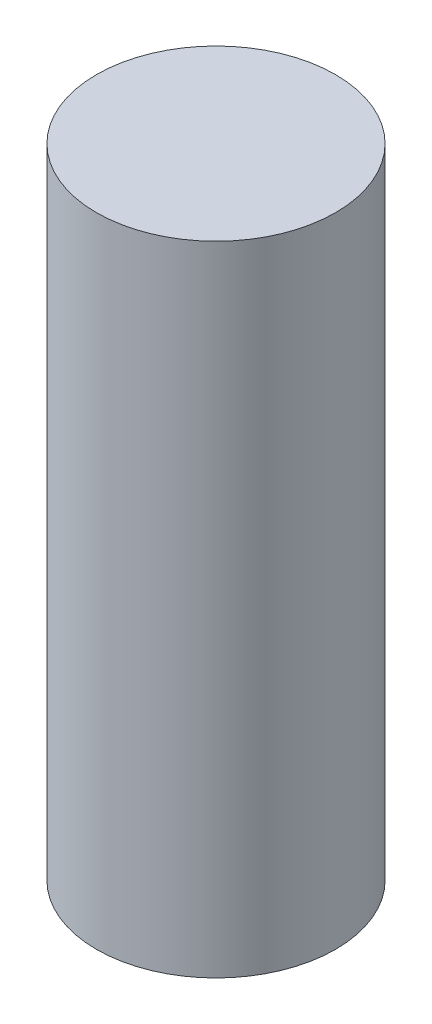
ISO-10303-21;
HEADER;
FILE_DESCRIPTION(('STEP AP214'),'2;1');
FILE_NAME('part.step','',(''),(''),'','','');
FILE_SCHEMA(('AUTOMOTIVE_DESIGN { 1 0 10303 214 1 1 1 1 }'));
ENDSEC;
DATA;
#1=APPLICATION_CONTEXT('core data for automotive mechanical design processes');
#2=APPLICATION_PROTOCOL_DEFINITION('international standard','automotive_design',2000,#1);
#3=PRODUCT_CONTEXT('',#1,'mechanical');
#4=PRODUCT('Part','Part','',(#3));
#5=PRODUCT_RELATED_PRODUCT_CATEGORY('part','',(#4));
#6=PRODUCT_DEFINITION_FORMATION('','',#4);
#7=PRODUCT_DEFINITION_CONTEXT('part definition',#1,'design');
#8=PRODUCT_DEFINITION('design','',#6,#7);
#9=PRODUCT_DEFINITION_SHAPE('','',#8);
#10=(LENGTH_UNIT() NAMED_UNIT(*) SI_UNIT(.MILLI.,.METRE.));
#11=(NAMED_UNIT(*) PLANE_ANGLE_UNIT() SI_UNIT($,.RADIAN.));
#12=(NAMED_UNIT(*) SI_UNIT($,.STERADIAN.) SOLID_ANGLE_UNIT());
#13=UNCERTAINTY_MEASURE_WITH_UNIT(LENGTH_MEASURE(1.E-05),#10,'distance_accuracy_value','');
#14=(GEOMETRIC_REPRESENTATION_CONTEXT(3) GLOBAL_UNCERTAINTY_ASSIGNED_CONTEXT((#13)) GLOBAL_UNIT_ASSIGNED_CONTEXT((#10,
#11,#12)) REPRESENTATION_CONTEXT('',''));
#15=CARTESIAN_POINT('',(0.,0.,0.));
#16=DIRECTION('',(0.,0.,1.));
#17=DIRECTION('',(1.,0.,0.));
#18=AXIS2_PLACEMENT_3D('',#15,#16,#17);
#19=CARTESIAN_POINT('',(0.,12.7,0.));
#20=DIRECTION('',(0.,-1.,0.));
#21=DIRECTION('',(0.,0.,-1.));
#22=AXIS2_PLACEMENT_3D('',#19,#20,#21);
#23=CYLINDRICAL_SURFACE('',#22,2.38);
#24=CARTESIAN_POINT('',(0.,12.7,0.));
#25=DIRECTION('',(0.,1.,0.));
#26=DIRECTION('',(0.,0.,1.));
#27=AXIS2_PLACEMENT_3D('',#24,#25,#26);
#28=CIRCLE('',#27,2.38);
#29=CARTESIAN_POINT('',(0.,12.7,2.38));
#30=VERTEX_POINT('',#29);
#31=EDGE_CURVE('E10',#30,#30,#28,.T.);
#32=ORIENTED_EDGE('',*,*,#31,.F.);
#33=EDGE_LOOP('',(#32));
#34=FACE_BOUND('',#33,.T.);
#35=CARTESIAN_POINT('',(0.,0.,0.));
#36=DIRECTION('',(0.,1.,0.));
#37=DIRECTION('',(0.,0.,1.));
#38=AXIS2_PLACEMENT_3D('',#35,#36,#37);
#39=CIRCLE('',#38,2.38);
#40=CARTESIAN_POINT('',(0.,0.,2.38));
#41=VERTEX_POINT('',#40);
#42=EDGE_CURVE('E43',#41,#41,#39,.T.);
#43=ORIENTED_EDGE('',*,*,#42,.T.);
#44=EDGE_LOOP('',(#43));
#45=FACE_BOUND('',#44,.T.);
#46=ADVANCED_FACE('F40',(#34,#45),#23,.T.);
#47=CARTESIAN_POINT('',(0.,12.7,0.));
#48=DIRECTION('',(0.,1.,0.));
#49=DIRECTION('',(0.,0.,1.));
#50=AXIS2_PLACEMENT_3D('',#47,#48,#49);
#51=PLANE('',#50);
#52=ORIENTED_EDGE('',*,*,#31,.T.);
#53=EDGE_LOOP('',(#52));
#54=FACE_BOUND('',#53,.T.);
#55=ADVANCED_FACE('F57',(#54),#51,.T.);
#56=CARTESIAN_POINT('',(0.,0.,0.));
#57=DIRECTION('',(0.,1.,0.));
#58=DIRECTION('',(0.,0.,1.));
#59=AXIS2_PLACEMENT_3D('',#56,#57,#58);
#60=PLANE('',#59);
#61=ORIENTED_EDGE('',*,*,#42,.F.);
#62=EDGE_LOOP('',(#61));
#63=FACE_BOUND('',#62,.T.);
#64=ADVANCED_FACE('F55',(#63),#60,.F.);
#65=CLOSED_SHELL('',(#46,#55,#64));
#66=MANIFOLD_SOLID_BREP('B2',#65);
#67=ADVANCED_BREP_SHAPE_REPRESENTATION('',(#18,#66),#14);
#68=SHAPE_DEFINITION_REPRESENTATION(#9,#67);
ENDSEC;
END-ISO-10303-21;
